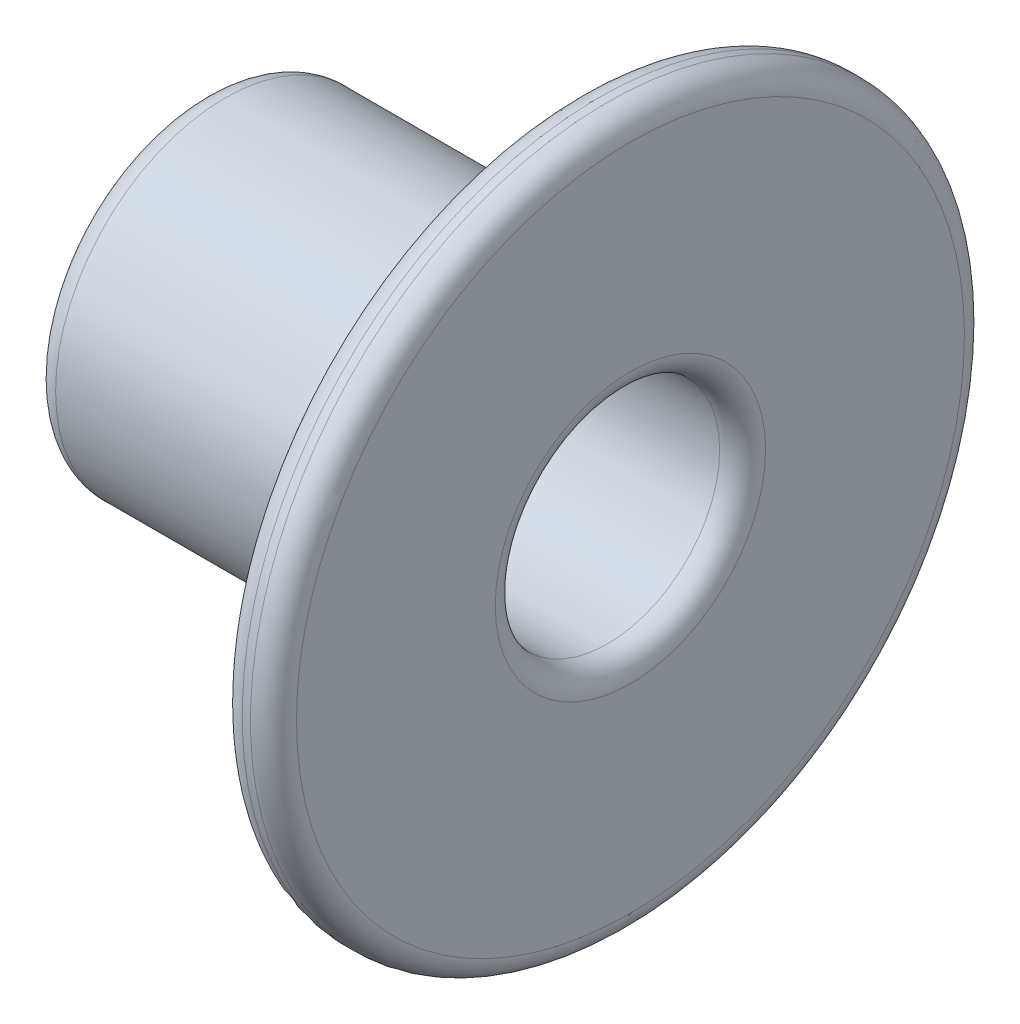
ISO-10303-21;
HEADER;
FILE_DESCRIPTION(('STEP AP214'),'2;1');
FILE_NAME('part.step','',(''),(''),'','','');
FILE_SCHEMA(('AUTOMOTIVE_DESIGN { 1 0 10303 214 1 1 1 1 }'));
ENDSEC;
DATA;
#1=APPLICATION_CONTEXT('core data for automotive mechanical design processes');
#2=APPLICATION_PROTOCOL_DEFINITION('international standard','automotive_design',2000,#1);
#3=PRODUCT_CONTEXT('',#1,'mechanical');
#4=PRODUCT('Part','Part','',(#3));
#5=PRODUCT_RELATED_PRODUCT_CATEGORY('part','',(#4));
#6=PRODUCT_DEFINITION_FORMATION('','',#4);
#7=PRODUCT_DEFINITION_CONTEXT('part definition',#1,'design');
#8=PRODUCT_DEFINITION('design','',#6,#7);
#9=PRODUCT_DEFINITION_SHAPE('','',#8);
#10=(LENGTH_UNIT() NAMED_UNIT(*) SI_UNIT(.MILLI.,.METRE.));
#11=(NAMED_UNIT(*) PLANE_ANGLE_UNIT() SI_UNIT($,.RADIAN.));
#12=(NAMED_UNIT(*) SI_UNIT($,.STERADIAN.) SOLID_ANGLE_UNIT());
#13=UNCERTAINTY_MEASURE_WITH_UNIT(LENGTH_MEASURE(1.E-05),#10,'distance_accuracy_value','');
#14=(GEOMETRIC_REPRESENTATION_CONTEXT(3) GLOBAL_UNCERTAINTY_ASSIGNED_CONTEXT((#13)) GLOBAL_UNIT_ASSIGNED_CONTEXT((#10,
#11,#12)) REPRESENTATION_CONTEXT('',''));
#15=CARTESIAN_POINT('',(0.,0.,0.));
#16=DIRECTION('',(0.,0.,1.));
#17=DIRECTION('',(1.,0.,0.));
#18=AXIS2_PLACEMENT_3D('',#15,#16,#17);
#19=CARTESIAN_POINT('',(-453.73,0.277000000000003,0.));
#20=DIRECTION('',(1.,0.,0.));
#21=DIRECTION('',(0.,0.,-1.));
#22=AXIS2_PLACEMENT_3D('',#19,#20,#21);
#23=TOROIDAL_SURFACE('',#22,8.105,1.27);
#24=CARTESIAN_POINT('',(-455.,0.277000000000004,0.));
#25=DIRECTION('',(1.,0.,0.));
#26=DIRECTION('',(0.,0.,-1.));
#27=AXIS2_PLACEMENT_3D('',#24,#25,#26);
#28=CIRCLE('',#27,8.10500000000005);
#29=CARTESIAN_POINT('',(-455.,0.277000000000004,-8.10500000000005));
#30=VERTEX_POINT('',#29);
#31=EDGE_CURVE('E10',#30,#30,#28,.T.);
#32=ORIENTED_EDGE('',*,*,#31,.T.);
#33=EDGE_LOOP('',(#32));
#34=FACE_BOUND('',#33,.T.);
#35=CARTESIAN_POINT('',(-453.73,0.277000000000004,0.));
#36=DIRECTION('',(1.,0.,0.));
#37=DIRECTION('',(0.,0.,-1.));
#38=AXIS2_PLACEMENT_3D('',#35,#36,#37);
#39=CIRCLE('',#38,9.375);
#40=CARTESIAN_POINT('',(-453.73,0.277000000000004,-9.375));
#41=VERTEX_POINT('',#40);
#42=EDGE_CURVE('E84',#41,#41,#39,.T.);
#43=ORIENTED_EDGE('',*,*,#42,.F.);
#44=EDGE_LOOP('',(#43));
#45=FACE_BOUND('',#44,.T.);
#46=ADVANCED_FACE('F37',(#34,#45),#23,.T.);
#47=CARTESIAN_POINT('',(-455.,8.38200000000006,0.));
#48=DIRECTION('',(-1.,0.,0.));
#49=DIRECTION('',(0.,0.,1.));
#50=AXIS2_PLACEMENT_3D('',#47,#48,#49);
#51=PLANE('',#50);
#52=ORIENTED_EDGE('',*,*,#31,.F.);
#53=EDGE_LOOP('',(#52));
#54=FACE_BOUND('',#53,.T.);
#55=ADVANCED_FACE('F93',(#54),#51,.T.);
#56=CARTESIAN_POINT('',(-450.,0.277000000000004,0.));
#57=DIRECTION('',(1.,0.,0.));
#58=DIRECTION('',(0.,0.,-1.));
#59=AXIS2_PLACEMENT_3D('',#56,#57,#58);
#60=PLANE('',#59);
#61=CARTESIAN_POINT('',(-450.,0.277000000000004,0.));
#62=DIRECTION('',(1.,0.,0.));
#63=DIRECTION('',(0.,0.,-1.));
#64=AXIS2_PLACEMENT_3D('',#61,#62,#63);
#65=CIRCLE('',#64,6.2);
#66=CARTESIAN_POINT('',(-450.,0.277000000000004,-6.2));
#67=VERTEX_POINT('',#66);
#68=EDGE_CURVE('E44',#67,#67,#65,.T.);
#69=ORIENTED_EDGE('',*,*,#68,.T.);
#70=EDGE_LOOP('',(#69));
#71=FACE_BOUND('',#70,.T.);
#72=ADVANCED_FACE('F97',(#71),#60,.T.);
#73=CARTESIAN_POINT('',(-455.001250002235,0.277000000000004,0.));
#74=DIRECTION('',(1.,0.,0.));
#75=DIRECTION('',(0.,0.,-1.));
#76=AXIS2_PLACEMENT_3D('',#73,#74,#75);
#77=CYLINDRICAL_SURFACE('',#76,6.2);
#78=CARTESIAN_POINT('',(-432.61241397916,0.277000000000004,0.));
#79=DIRECTION('',(1.,0.,0.));
#80=DIRECTION('',(0.,0.,-1.));
#81=AXIS2_PLACEMENT_3D('',#78,#79,#80);
#82=CIRCLE('',#81,6.2);
#83=CARTESIAN_POINT('',(-432.61241397916,0.277000000000004,-6.2));
#84=VERTEX_POINT('',#83);
#85=EDGE_CURVE('E49',#84,#84,#82,.T.);
#86=ORIENTED_EDGE('',*,*,#85,.T.);
#87=EDGE_LOOP('',(#86));
#88=FACE_BOUND('',#87,.T.);
#89=ORIENTED_EDGE('',*,*,#68,.F.);
#90=EDGE_LOOP('',(#89));
#91=FACE_BOUND('',#90,.T.);
#92=ADVANCED_FACE('F102',(#88,#91),#77,.F.);
#93=CARTESIAN_POINT('',(-432.61241397916,0.277000000000004,0.));
#94=DIRECTION('',(1.,0.,0.));
#95=DIRECTION('',(0.,0.,-1.));
#96=AXIS2_PLACEMENT_3D('',#93,#94,#95);
#97=TOROIDAL_SURFACE('',#96,7.47,1.27);
#98=CARTESIAN_POINT('',(-431.34241397916,0.277000000000004,0.));
#99=DIRECTION('',(1.,0.,0.));
#100=DIRECTION('',(0.,0.,-1.));
#101=AXIS2_PLACEMENT_3D('',#98,#99,#100);
#102=CIRCLE('',#101,7.47);
#103=CARTESIAN_POINT('',(-431.34241397916,0.277000000000004,-7.47));
#104=VERTEX_POINT('',#103);
#105=EDGE_CURVE('E54',#104,#104,#102,.T.);
#106=ORIENTED_EDGE('',*,*,#105,.T.);
#107=EDGE_LOOP('',(#106));
#108=FACE_BOUND('',#107,.T.);
#109=ORIENTED_EDGE('',*,*,#85,.F.);
#110=EDGE_LOOP('',(#109));
#111=FACE_BOUND('',#110,.T.);
#112=ADVANCED_FACE('F107',(#108,#111),#97,.T.);
#113=CARTESIAN_POINT('',(-431.34241397916,7.747,0.));
#114=DIRECTION('',(1.,0.,0.));
#115=DIRECTION('',(0.,0.,-1.));
#116=AXIS2_PLACEMENT_3D('',#113,#114,#115);
#117=PLANE('',#116);
#118=CARTESIAN_POINT('',(-431.34241397916,0.277000000000004,0.));
#119=DIRECTION('',(1.,0.,0.));
#120=DIRECTION('',(0.,0.,-1.));
#121=AXIS2_PLACEMENT_3D('',#118,#119,#120);
#122=CIRCLE('',#121,18.453);
#123=CARTESIAN_POINT('',(-431.34241397916,0.277000000000004,-18.453));
#124=VERTEX_POINT('',#123);
#125=EDGE_CURVE('E60',#124,#124,#122,.T.);
#126=ORIENTED_EDGE('',*,*,#125,.T.);
#127=EDGE_LOOP('',(#126));
#128=FACE_BOUND('',#127,.T.);
#129=ORIENTED_EDGE('',*,*,#105,.F.);
#130=EDGE_LOOP('',(#129));
#131=FACE_BOUND('',#130,.T.);
#132=ADVANCED_FACE('F111',(#128,#131),#117,.T.);
#133=CARTESIAN_POINT('',(-432.61241397916,0.277000000000003,0.));
#134=DIRECTION('',(1.,0.,0.));
#135=DIRECTION('',(0.,0.,-1.));
#136=AXIS2_PLACEMENT_3D('',#133,#134,#135);
#137=TOROIDAL_SURFACE('',#136,18.453,1.27);
#138=CARTESIAN_POINT('',(-432.61241397916,0.277000000000004,0.));
#139=DIRECTION('',(1.,0.,0.));
#140=DIRECTION('',(0.,0.,-1.));
#141=AXIS2_PLACEMENT_3D('',#138,#139,#140);
#142=CIRCLE('',#141,19.723);
#143=CARTESIAN_POINT('',(-432.61241397916,0.277000000000004,-19.723));
#144=VERTEX_POINT('',#143);
#145=EDGE_CURVE('E64',#144,#144,#142,.T.);
#146=ORIENTED_EDGE('',*,*,#145,.T.);
#147=EDGE_LOOP('',(#146));
#148=FACE_BOUND('',#147,.T.);
#149=ORIENTED_EDGE('',*,*,#125,.F.);
#150=EDGE_LOOP('',(#149));
#151=FACE_BOUND('',#150,.T.);
#152=ADVANCED_FACE('F115',(#148,#151),#137,.T.);
#153=CARTESIAN_POINT('',(-455.001250002235,0.277000000000004,0.));
#154=DIRECTION('',(1.,0.,0.));
#155=DIRECTION('',(0.,0.,-1.));
#156=AXIS2_PLACEMENT_3D('',#153,#154,#155);
#157=CYLINDRICAL_SURFACE('',#156,19.723);
#158=CARTESIAN_POINT('',(-433.07241397916,0.277000000000004,0.));
#159=DIRECTION('',(1.,0.,0.));
#160=DIRECTION('',(0.,0.,-1.));
#161=AXIS2_PLACEMENT_3D('',#158,#159,#160);
#162=CIRCLE('',#161,19.723);
#163=CARTESIAN_POINT('',(-433.07241397916,0.277000000000004,-19.723));
#164=VERTEX_POINT('',#163);
#165=EDGE_CURVE('E68',#164,#164,#162,.T.);
#166=ORIENTED_EDGE('',*,*,#165,.T.);
#167=EDGE_LOOP('',(#166));
#168=FACE_BOUND('',#167,.T.);
#169=ORIENTED_EDGE('',*,*,#145,.F.);
#170=EDGE_LOOP('',(#169));
#171=FACE_BOUND('',#170,.T.);
#172=ADVANCED_FACE('F119',(#168,#171),#157,.T.);
#173=CARTESIAN_POINT('',(-433.07241397916,0.277000000000003,0.));
#174=DIRECTION('',(1.,0.,0.));
#175=DIRECTION('',(0.,0.,-1.));
#176=AXIS2_PLACEMENT_3D('',#173,#174,#175);
#177=TOROIDAL_SURFACE('',#176,18.453,1.27);
#178=CARTESIAN_POINT('',(-434.34241397916,0.277000000000004,0.));
#179=DIRECTION('',(1.,0.,0.));
#180=DIRECTION('',(0.,0.,-1.));
#181=AXIS2_PLACEMENT_3D('',#178,#179,#180);
#182=CIRCLE('',#181,18.453);
#183=CARTESIAN_POINT('',(-434.34241397916,0.277000000000004,-18.453));
#184=VERTEX_POINT('',#183);
#185=EDGE_CURVE('E72',#184,#184,#182,.T.);
#186=ORIENTED_EDGE('',*,*,#185,.T.);
#187=EDGE_LOOP('',(#186));
#188=FACE_BOUND('',#187,.T.);
#189=ORIENTED_EDGE('',*,*,#165,.F.);
#190=EDGE_LOOP('',(#189));
#191=FACE_BOUND('',#190,.T.);
#192=ADVANCED_FACE('F123',(#188,#191),#177,.T.);
#193=CARTESIAN_POINT('',(-434.34241397916,18.73,0.));
#194=DIRECTION('',(-1.,0.,0.));
#195=DIRECTION('',(0.,0.,1.));
#196=AXIS2_PLACEMENT_3D('',#193,#194,#195);
#197=PLANE('',#196);
#198=CARTESIAN_POINT('',(-434.34241397916,0.277000000000004,0.));
#199=DIRECTION('',(1.,0.,0.));
#200=DIRECTION('',(0.,0.,-1.));
#201=AXIS2_PLACEMENT_3D('',#198,#199,#200);
#202=CIRCLE('',#201,11.375);
#203=CARTESIAN_POINT('',(-434.34241397916,0.277000000000004,-11.375));
#204=VERTEX_POINT('',#203);
#205=EDGE_CURVE('E76',#204,#204,#202,.T.);
#206=ORIENTED_EDGE('',*,*,#205,.T.);
#207=EDGE_LOOP('',(#206));
#208=FACE_BOUND('',#207,.T.);
#209=ORIENTED_EDGE('',*,*,#185,.F.);
#210=EDGE_LOOP('',(#209));
#211=FACE_BOUND('',#210,.T.);
#212=ADVANCED_FACE('F127',(#208,#211),#197,.T.);
#213=CARTESIAN_POINT('',(-436.34241397916,0.277000000000003,0.));
#214=DIRECTION('',(1.,0.,0.));
#215=DIRECTION('',(0.,0.,-1.));
#216=AXIS2_PLACEMENT_3D('',#213,#214,#215);
#217=TOROIDAL_SURFACE('',#216,11.375,2.);
#218=CARTESIAN_POINT('',(-436.34241397916,0.277000000000004,0.));
#219=DIRECTION('',(1.,0.,0.));
#220=DIRECTION('',(0.,0.,-1.));
#221=AXIS2_PLACEMENT_3D('',#218,#219,#220);
#222=CIRCLE('',#221,9.37499999999999);
#223=CARTESIAN_POINT('',(-436.34241397916,0.277000000000004,-9.37499999999999));
#224=VERTEX_POINT('',#223);
#225=EDGE_CURVE('E80',#224,#224,#222,.T.);
#226=ORIENTED_EDGE('',*,*,#225,.T.);
#227=EDGE_LOOP('',(#226));
#228=FACE_BOUND('',#227,.T.);
#229=ORIENTED_EDGE('',*,*,#205,.F.);
#230=EDGE_LOOP('',(#229));
#231=FACE_BOUND('',#230,.T.);
#232=ADVANCED_FACE('F131',(#228,#231),#217,.F.);
#233=CARTESIAN_POINT('',(-455.001250002235,0.277000000000004,0.));
#234=DIRECTION('',(1.,0.,0.));
#235=DIRECTION('',(0.,0.,-1.));
#236=AXIS2_PLACEMENT_3D('',#233,#234,#235);
#237=CYLINDRICAL_SURFACE('',#236,9.375);
#238=ORIENTED_EDGE('',*,*,#42,.T.);
#239=EDGE_LOOP('',(#238));
#240=FACE_BOUND('',#239,.T.);
#241=ORIENTED_EDGE('',*,*,#225,.F.);
#242=EDGE_LOOP('',(#241));
#243=FACE_BOUND('',#242,.T.);
#244=ADVANCED_FACE('F89',(#240,#243),#237,.T.);
#245=CLOSED_SHELL('',(#46,#55,#72,#92,#112,#132,#152,#172,#192,#212,#232,#244));
#246=MANIFOLD_SOLID_BREP('B2',#245);
#247=ADVANCED_BREP_SHAPE_REPRESENTATION('',(#18,#246),#14);
#248=SHAPE_DEFINITION_REPRESENTATION(#9,#247);
ENDSEC;
END-ISO-10303-21;
